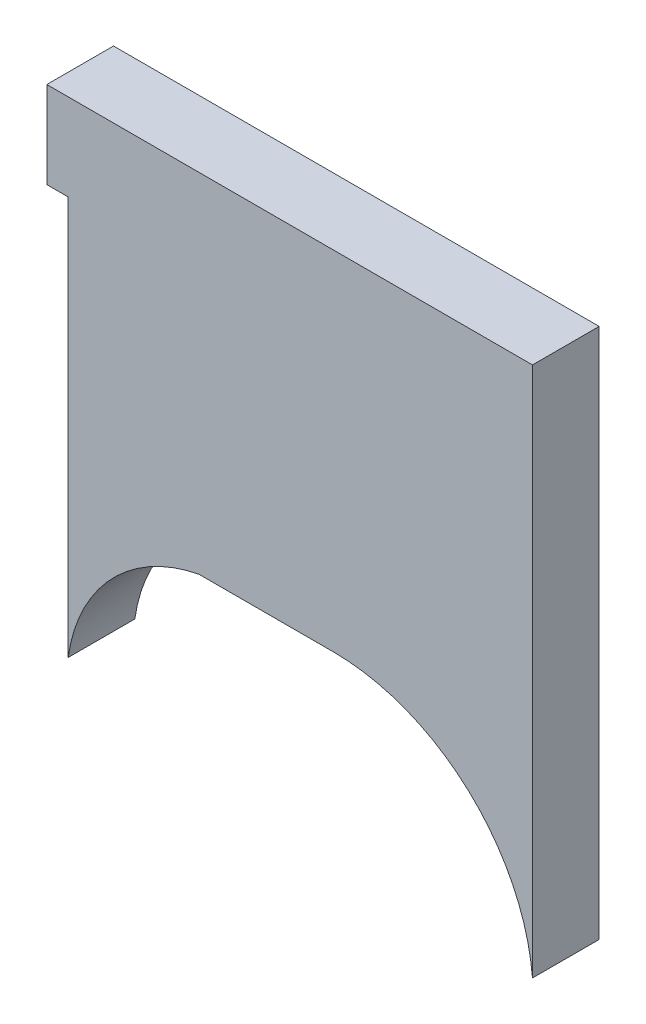
ISO-10303-21;
HEADER;
FILE_DESCRIPTION(('STEP AP214'),'2;1');
FILE_NAME('part.step','',(''),(''),'','','');
FILE_SCHEMA(('AUTOMOTIVE_DESIGN { 1 0 10303 214 1 1 1 1 }'));
ENDSEC;
DATA;
#1=APPLICATION_CONTEXT('core data for automotive mechanical design processes');
#2=APPLICATION_PROTOCOL_DEFINITION('international standard','automotive_design',2000,#1);
#3=PRODUCT_CONTEXT('',#1,'mechanical');
#4=PRODUCT('Part','Part','',(#3));
#5=PRODUCT_RELATED_PRODUCT_CATEGORY('part','',(#4));
#6=PRODUCT_DEFINITION_FORMATION('','',#4);
#7=PRODUCT_DEFINITION_CONTEXT('part definition',#1,'design');
#8=PRODUCT_DEFINITION('design','',#6,#7);
#9=PRODUCT_DEFINITION_SHAPE('','',#8);
#10=(LENGTH_UNIT() NAMED_UNIT(*) SI_UNIT(.MILLI.,.METRE.));
#11=(NAMED_UNIT(*) PLANE_ANGLE_UNIT() SI_UNIT($,.RADIAN.));
#12=(NAMED_UNIT(*) SI_UNIT($,.STERADIAN.) SOLID_ANGLE_UNIT());
#13=UNCERTAINTY_MEASURE_WITH_UNIT(LENGTH_MEASURE(1.E-05),#10,'distance_accuracy_value','');
#14=(GEOMETRIC_REPRESENTATION_CONTEXT(3) GLOBAL_UNCERTAINTY_ASSIGNED_CONTEXT((#13)) GLOBAL_UNIT_ASSIGNED_CONTEXT((#10,
#11,#12)) REPRESENTATION_CONTEXT('',''));
#15=CARTESIAN_POINT('',(0.,0.,0.));
#16=DIRECTION('',(0.,0.,1.));
#17=DIRECTION('',(1.,0.,0.));
#18=AXIS2_PLACEMENT_3D('',#15,#16,#17);
#19=CARTESIAN_POINT('',(-62.7790186857379,32.6323361764117,3.175));
#20=DIRECTION('',(0.,0.,-1.));
#21=DIRECTION('',(-1.,0.,0.));
#22=AXIS2_PLACEMENT_3D('',#19,#20,#21);
#23=CYLINDRICAL_SURFACE('',#22,9.525);
#24=CARTESIAN_POINT('',(-62.7790186857379,32.6323361764117,0.));
#25=DIRECTION('',(0.,0.,-1.));
#26=DIRECTION('',(-1.,0.,0.));
#27=AXIS2_PLACEMENT_3D('',#24,#25,#26);
#28=CIRCLE('',#27,9.525);
#29=CARTESIAN_POINT('',(-62.7790186857379,42.1573361764117,0.));
#30=VERTEX_POINT('',#29);
#31=CARTESIAN_POINT('',(-53.2893553125021,33.4520398196066,0.));
#32=VERTEX_POINT('',#31);
#33=EDGE_CURVE('E130',#30,#32,#28,.T.);
#34=ORIENTED_EDGE('',*,*,#33,.T.);
#35=DIRECTION('',(0.,0.,-1.));
#36=VECTOR('',#35,1.);
#37=CARTESIAN_POINT('',(-53.2893553125021,33.4520398196066,3.175));
#38=LINE('',#37,#36);
#39=CARTESIAN_POINT('',(-53.2893553125021,33.4520398196066,3.175));
#40=VERTEX_POINT('',#39);
#41=EDGE_CURVE('E11',#40,#32,#38,.T.);
#42=ORIENTED_EDGE('',*,*,#41,.F.);
#43=CARTESIAN_POINT('',(-62.7790186857379,32.6323361764117,3.175));
#44=DIRECTION('',(0.,0.,-1.));
#45=DIRECTION('',(-1.,0.,0.));
#46=AXIS2_PLACEMENT_3D('',#43,#44,#45);
#47=CIRCLE('',#46,9.525);
#48=CARTESIAN_POINT('',(-62.7790186857379,42.1573361764117,3.175));
#49=VERTEX_POINT('',#48);
#50=EDGE_CURVE('E146',#49,#40,#47,.T.);
#51=ORIENTED_EDGE('',*,*,#50,.F.);
#52=DIRECTION('',(0.,0.,-1.));
#53=VECTOR('',#52,1.);
#54=CARTESIAN_POINT('',(-62.7790186857379,42.1573361764117,3.175));
#55=LINE('',#54,#53);
#56=EDGE_CURVE('E126',#49,#30,#55,.T.);
#57=ORIENTED_EDGE('',*,*,#56,.T.);
#58=EDGE_LOOP('',(#34,#42,#51,#57));
#59=FACE_BOUND('',#58,.T.);
#60=ADVANCED_FACE('F33',(#59),#23,.F.);
#61=CARTESIAN_POINT('',(-53.2893553125021,44.6973361764117,3.175));
#62=DIRECTION('',(-1.,0.,0.));
#63=DIRECTION('',(0.,0.,1.));
#64=AXIS2_PLACEMENT_3D('',#61,#62,#63);
#65=PLANE('',#64);
#66=DIRECTION('',(0.,1.,0.));
#67=VECTOR('',#66,1.);
#68=CARTESIAN_POINT('',(-53.2893553125021,44.6973361764117,0.));
#69=LINE('',#68,#67);
#70=CARTESIAN_POINT('',(-53.2893553125021,58.7268714042452,0.));
#71=VERTEX_POINT('',#70);
#72=EDGE_CURVE('E133',#32,#71,#69,.T.);
#73=ORIENTED_EDGE('',*,*,#72,.T.);
#74=DIRECTION('',(0.,0.,-1.));
#75=VECTOR('',#74,1.);
#76=CARTESIAN_POINT('',(-53.2893553125021,58.7268714042452,3.175));
#77=LINE('',#76,#75);
#78=CARTESIAN_POINT('',(-53.2893553125021,58.7268714042452,3.175));
#79=VERTEX_POINT('',#78);
#80=EDGE_CURVE('E41',#79,#71,#77,.T.);
#81=ORIENTED_EDGE('',*,*,#80,.F.);
#82=DIRECTION('',(0.,1.,0.));
#83=VECTOR('',#82,1.);
#84=CARTESIAN_POINT('',(-53.2893553125021,33.4520398196066,3.175));
#85=LINE('',#84,#83);
#86=EDGE_CURVE('E90',#40,#79,#85,.T.);
#87=ORIENTED_EDGE('',*,*,#86,.F.);
#88=ORIENTED_EDGE('',*,*,#41,.T.);
#89=EDGE_LOOP('',(#73,#81,#87,#88));
#90=FACE_BOUND('',#89,.T.);
#91=ADVANCED_FACE('F161',(#90),#65,.F.);
#92=CARTESIAN_POINT('',(-76.4079899533384,58.7268714042452,3.175));
#93=DIRECTION('',(0.,-1.,0.));
#94=DIRECTION('',(0.,0.,-1.));
#95=AXIS2_PLACEMENT_3D('',#92,#93,#94);
#96=PLANE('',#95);
#97=DIRECTION('',(-1.,0.,0.));
#98=VECTOR('',#97,1.);
#99=CARTESIAN_POINT('',(-76.4079899533384,58.7268714042452,0.));
#100=LINE('',#99,#98);
#101=CARTESIAN_POINT('',(-76.4079899533384,58.7268714042452,0.));
#102=VERTEX_POINT('',#101);
#103=EDGE_CURVE('E136',#71,#102,#100,.T.);
#104=ORIENTED_EDGE('',*,*,#103,.T.);
#105=DIRECTION('',(0.,0.,-1.));
#106=VECTOR('',#105,1.);
#107=CARTESIAN_POINT('',(-76.4079899533384,58.7268714042452,3.175));
#108=LINE('',#107,#106);
#109=CARTESIAN_POINT('',(-76.4079899533384,58.7268714042452,3.175));
#110=VERTEX_POINT('',#109);
#111=EDGE_CURVE('E153',#110,#102,#108,.T.);
#112=ORIENTED_EDGE('',*,*,#111,.F.);
#113=DIRECTION('',(-1.,0.,0.));
#114=VECTOR('',#113,1.);
#115=CARTESIAN_POINT('',(-53.2893553125021,58.7268714042452,3.175));
#116=LINE('',#115,#114);
#117=EDGE_CURVE('E160',#79,#110,#116,.T.);
#118=ORIENTED_EDGE('',*,*,#117,.F.);
#119=ORIENTED_EDGE('',*,*,#80,.T.);
#120=EDGE_LOOP('',(#104,#112,#118,#119));
#121=FACE_BOUND('',#120,.T.);
#122=ADVANCED_FACE('F158',(#121),#96,.F.);
#123=CARTESIAN_POINT('',(-76.4079899533384,54.5993714042452,3.175));
#124=DIRECTION('',(1.,0.,0.));
#125=DIRECTION('',(0.,0.,-1.));
#126=AXIS2_PLACEMENT_3D('',#123,#124,#125);
#127=PLANE('',#126);
#128=DIRECTION('',(0.,-1.,0.));
#129=VECTOR('',#128,1.);
#130=CARTESIAN_POINT('',(-76.4079899533384,54.5993714042452,0.));
#131=LINE('',#130,#129);
#132=CARTESIAN_POINT('',(-76.4079899533384,54.5993714042452,0.));
#133=VERTEX_POINT('',#132);
#134=EDGE_CURVE('E138',#102,#133,#131,.T.);
#135=ORIENTED_EDGE('',*,*,#134,.T.);
#136=DIRECTION('',(0.,0.,-1.));
#137=VECTOR('',#136,1.);
#138=CARTESIAN_POINT('',(-76.4079899533384,54.5993714042452,3.175));
#139=LINE('',#138,#137);
#140=CARTESIAN_POINT('',(-76.4079899533384,54.5993714042452,3.175));
#141=VERTEX_POINT('',#140);
#142=EDGE_CURVE('E150',#141,#133,#139,.T.);
#143=ORIENTED_EDGE('',*,*,#142,.F.);
#144=DIRECTION('',(0.,-1.,0.));
#145=VECTOR('',#144,1.);
#146=CARTESIAN_POINT('',(-76.4079899533384,54.5993714042452,3.175));
#147=LINE('',#146,#145);
#148=EDGE_CURVE('E172',#110,#141,#147,.T.);
#149=ORIENTED_EDGE('',*,*,#148,.F.);
#150=ORIENTED_EDGE('',*,*,#111,.T.);
#151=EDGE_LOOP('',(#135,#143,#149,#150));
#152=FACE_BOUND('',#151,.T.);
#153=ADVANCED_FACE('F168',(#152),#127,.F.);
#154=CARTESIAN_POINT('',(-75.3929350473866,54.5993714042452,3.175));
#155=DIRECTION('',(0.,1.,0.));
#156=DIRECTION('',(0.,0.,1.));
#157=AXIS2_PLACEMENT_3D('',#154,#155,#156);
#158=PLANE('',#157);
#159=DIRECTION('',(1.,0.,0.));
#160=VECTOR('',#159,1.);
#161=CARTESIAN_POINT('',(-75.3929350473866,54.5993714042452,0.));
#162=LINE('',#161,#160);
#163=CARTESIAN_POINT('',(-75.3929350473866,54.5993714042452,0.));
#164=VERTEX_POINT('',#163);
#165=EDGE_CURVE('E140',#133,#164,#162,.T.);
#166=ORIENTED_EDGE('',*,*,#165,.T.);
#167=DIRECTION('',(0.,0.,-1.));
#168=VECTOR('',#167,1.);
#169=CARTESIAN_POINT('',(-75.3929350473866,54.5993714042452,3.175));
#170=LINE('',#169,#168);
#171=CARTESIAN_POINT('',(-75.3929350473866,54.5993714042452,3.175));
#172=VERTEX_POINT('',#171);
#173=EDGE_CURVE('E121',#172,#164,#170,.T.);
#174=ORIENTED_EDGE('',*,*,#173,.F.);
#175=DIRECTION('',(1.,0.,0.));
#176=VECTOR('',#175,1.);
#177=CARTESIAN_POINT('',(-75.3929350473866,54.5993714042452,3.175));
#178=LINE('',#177,#176);
#179=EDGE_CURVE('E110',#141,#172,#178,.T.);
#180=ORIENTED_EDGE('',*,*,#179,.F.);
#181=ORIENTED_EDGE('',*,*,#142,.T.);
#182=EDGE_LOOP('',(#166,#174,#180,#181));
#183=FACE_BOUND('',#182,.T.);
#184=ADVANCED_FACE('F171',(#183),#158,.F.);
#185=CARTESIAN_POINT('',(-75.3929350473866,35.6120173392133,3.175));
#186=DIRECTION('',(1.,0.,0.));
#187=DIRECTION('',(0.,0.,-1.));
#188=AXIS2_PLACEMENT_3D('',#185,#186,#187);
#189=PLANE('',#188);
#190=DIRECTION('',(0.,-1.,0.));
#191=VECTOR('',#190,1.);
#192=CARTESIAN_POINT('',(-75.3929350473866,35.6120173392133,0.));
#193=LINE('',#192,#191);
#194=CARTESIAN_POINT('',(-75.3929350473866,35.6120173392133,0.));
#195=VERTEX_POINT('',#194);
#196=EDGE_CURVE('E119',#164,#195,#193,.T.);
#197=ORIENTED_EDGE('',*,*,#196,.T.);
#198=DIRECTION('',(0.,0.,-1.));
#199=VECTOR('',#198,1.);
#200=CARTESIAN_POINT('',(-75.3929350473866,35.6120173392133,3.175));
#201=LINE('',#200,#199);
#202=CARTESIAN_POINT('',(-75.3929350473866,35.6120173392133,3.175));
#203=VERTEX_POINT('',#202);
#204=EDGE_CURVE('E116',#203,#195,#201,.T.);
#205=ORIENTED_EDGE('',*,*,#204,.F.);
#206=DIRECTION('',(0.,-1.,0.));
#207=VECTOR('',#206,1.);
#208=CARTESIAN_POINT('',(-75.3929350473866,35.6120173392133,3.175));
#209=LINE('',#208,#207);
#210=EDGE_CURVE('E103',#172,#203,#209,.T.);
#211=ORIENTED_EDGE('',*,*,#210,.F.);
#212=ORIENTED_EDGE('',*,*,#173,.T.);
#213=EDGE_LOOP('',(#197,#205,#211,#212));
#214=FACE_BOUND('',#213,.T.);
#215=ADVANCED_FACE('F117',(#214),#189,.F.);
#216=CARTESIAN_POINT('',(-67.7051381522331,34.5320285794099,3.175));
#217=DIRECTION('',(0.,0.,-1.));
#218=DIRECTION('',(-1.,0.,0.));
#219=AXIS2_PLACEMENT_3D('',#216,#217,#218);
#220=CYLINDRICAL_SURFACE('',#219,7.76328518234611);
#221=CARTESIAN_POINT('',(-67.7051381522331,34.5320285794099,0.));
#222=DIRECTION('',(0.,0.,-1.));
#223=DIRECTION('',(-1.,0.,0.));
#224=AXIS2_PLACEMENT_3D('',#221,#222,#223);
#225=CIRCLE('',#224,7.76328518234611);
#226=CARTESIAN_POINT('',(-69.1622863511277,42.1573361764117,0.));
#227=VERTEX_POINT('',#226);
#228=EDGE_CURVE('E143',#195,#227,#225,.T.);
#229=ORIENTED_EDGE('',*,*,#228,.T.);
#230=DIRECTION('',(0.,0.,-1.));
#231=VECTOR('',#230,1.);
#232=CARTESIAN_POINT('',(-69.1622863511277,42.1573361764117,3.175));
#233=LINE('',#232,#231);
#234=CARTESIAN_POINT('',(-69.1622863511277,42.1573361764117,3.175));
#235=VERTEX_POINT('',#234);
#236=EDGE_CURVE('E122',#235,#227,#233,.T.);
#237=ORIENTED_EDGE('',*,*,#236,.F.);
#238=CARTESIAN_POINT('',(-67.7051381522331,34.5320285794099,3.175));
#239=DIRECTION('',(0.,0.,-1.));
#240=DIRECTION('',(-1.,0.,0.));
#241=AXIS2_PLACEMENT_3D('',#238,#239,#240);
#242=CIRCLE('',#241,7.76328518234611);
#243=EDGE_CURVE('E107',#203,#235,#242,.T.);
#244=ORIENTED_EDGE('',*,*,#243,.F.);
#245=ORIENTED_EDGE('',*,*,#204,.T.);
#246=EDGE_LOOP('',(#229,#237,#244,#245));
#247=FACE_BOUND('',#246,.T.);
#248=ADVANCED_FACE('F124',(#247),#220,.F.);
#249=CARTESIAN_POINT('',(-66.2479899533384,42.1573361764117,3.175));
#250=DIRECTION('',(0.,1.,0.));
#251=DIRECTION('',(0.,0.,1.));
#252=AXIS2_PLACEMENT_3D('',#249,#250,#251);
#253=PLANE('',#252);
#254=DIRECTION('',(1.,0.,0.));
#255=VECTOR('',#254,1.);
#256=CARTESIAN_POINT('',(-66.2479899533384,42.1573361764117,0.));
#257=LINE('',#256,#255);
#258=EDGE_CURVE('E78',#227,#30,#257,.T.);
#259=ORIENTED_EDGE('',*,*,#258,.T.);
#260=ORIENTED_EDGE('',*,*,#56,.F.);
#261=DIRECTION('',(1.,0.,0.));
#262=VECTOR('',#261,1.);
#263=CARTESIAN_POINT('',(-69.1622863511277,42.1573361764117,3.175));
#264=LINE('',#263,#262);
#265=EDGE_CURVE('E49',#235,#49,#264,.T.);
#266=ORIENTED_EDGE('',*,*,#265,.F.);
#267=ORIENTED_EDGE('',*,*,#236,.T.);
#268=EDGE_LOOP('',(#259,#260,#266,#267));
#269=FACE_BOUND('',#268,.T.);
#270=ADVANCED_FACE('F179',(#269),#253,.F.);
#271=CARTESIAN_POINT('',(-62.7790186857379,32.6323361764117,3.175));
#272=DIRECTION('',(0.,0.,-1.));
#273=DIRECTION('',(-1.,0.,0.));
#274=AXIS2_PLACEMENT_3D('',#271,#272,#273);
#275=PLANE('',#274);
#276=ORIENTED_EDGE('',*,*,#50,.T.);
#277=ORIENTED_EDGE('',*,*,#86,.T.);
#278=ORIENTED_EDGE('',*,*,#117,.T.);
#279=ORIENTED_EDGE('',*,*,#148,.T.);
#280=ORIENTED_EDGE('',*,*,#179,.T.);
#281=ORIENTED_EDGE('',*,*,#210,.T.);
#282=ORIENTED_EDGE('',*,*,#243,.T.);
#283=ORIENTED_EDGE('',*,*,#265,.T.);
#284=EDGE_LOOP('',(#276,#277,#278,#279,#280,#281,#282,#283));
#285=FACE_BOUND('',#284,.T.);
#286=ADVANCED_FACE('F105',(#285),#275,.F.);
#287=CARTESIAN_POINT('',(-62.7790186857379,32.6323361764117,0.));
#288=DIRECTION('',(0.,0.,-1.));
#289=DIRECTION('',(-1.,0.,0.));
#290=AXIS2_PLACEMENT_3D('',#287,#288,#289);
#291=PLANE('',#290);
#292=ORIENTED_EDGE('',*,*,#33,.F.);
#293=ORIENTED_EDGE('',*,*,#258,.F.);
#294=ORIENTED_EDGE('',*,*,#228,.F.);
#295=ORIENTED_EDGE('',*,*,#196,.F.);
#296=ORIENTED_EDGE('',*,*,#165,.F.);
#297=ORIENTED_EDGE('',*,*,#134,.F.);
#298=ORIENTED_EDGE('',*,*,#103,.F.);
#299=ORIENTED_EDGE('',*,*,#72,.F.);
#300=EDGE_LOOP('',(#292,#293,#294,#295,#296,#297,#298,#299));
#301=FACE_BOUND('',#300,.T.);
#302=ADVANCED_FACE('F163',(#301),#291,.T.);
#303=CLOSED_SHELL('',(#60,#91,#122,#153,#184,#215,#248,#270,#286,#302));
#304=MANIFOLD_SOLID_BREP('B2',#303);
#305=ADVANCED_BREP_SHAPE_REPRESENTATION('',(#18,#304),#14);
#306=SHAPE_DEFINITION_REPRESENTATION(#9,#305);
ENDSEC;
END-ISO-10303-21;
